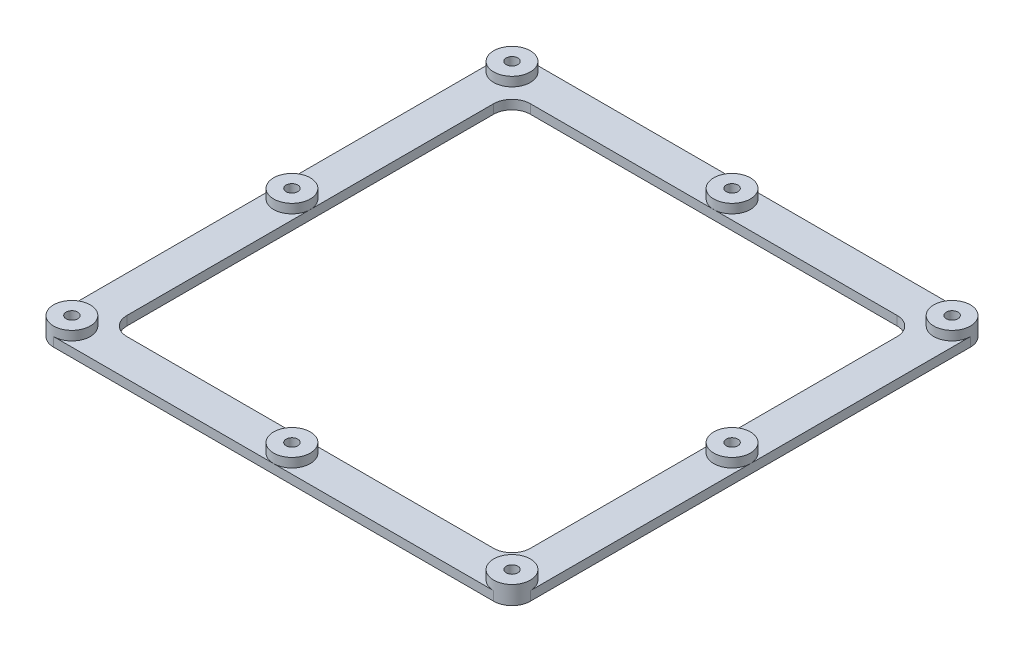
ISO-10303-21;
HEADER;
FILE_DESCRIPTION(('STEP AP214'),'2;1');
FILE_NAME('part.step','',(''),(''),'','','');
FILE_SCHEMA(('AUTOMOTIVE_DESIGN { 1 0 10303 214 1 1 1 1 }'));
ENDSEC;
DATA;
#1=APPLICATION_CONTEXT('core data for automotive mechanical design processes');
#2=APPLICATION_PROTOCOL_DEFINITION('international standard','automotive_design',2000,#1);
#3=PRODUCT_CONTEXT('',#1,'mechanical');
#4=PRODUCT('Part','Part','',(#3));
#5=PRODUCT_RELATED_PRODUCT_CATEGORY('part','',(#4));
#6=PRODUCT_DEFINITION_FORMATION('','',#4);
#7=PRODUCT_DEFINITION_CONTEXT('part definition',#1,'design');
#8=PRODUCT_DEFINITION('design','',#6,#7);
#9=PRODUCT_DEFINITION_SHAPE('','',#8);
#10=(LENGTH_UNIT() NAMED_UNIT(*) SI_UNIT(.MILLI.,.METRE.));
#11=(NAMED_UNIT(*) PLANE_ANGLE_UNIT() SI_UNIT($,.RADIAN.));
#12=(NAMED_UNIT(*) SI_UNIT($,.STERADIAN.) SOLID_ANGLE_UNIT());
#13=UNCERTAINTY_MEASURE_WITH_UNIT(LENGTH_MEASURE(1.E-05),#10,'distance_accuracy_value','');
#14=(GEOMETRIC_REPRESENTATION_CONTEXT(3) GLOBAL_UNCERTAINTY_ASSIGNED_CONTEXT((#13)) GLOBAL_UNIT_ASSIGNED_CONTEXT((#10,
#11,#12)) REPRESENTATION_CONTEXT('',''));
#15=CARTESIAN_POINT('',(0.,0.,0.));
#16=DIRECTION('',(0.,0.,1.));
#17=DIRECTION('',(1.,0.,0.));
#18=AXIS2_PLACEMENT_3D('',#15,#16,#17);
#19=CARTESIAN_POINT('',(0.,6.35,0.));
#20=DIRECTION('',(0.,1.,0.));
#21=DIRECTION('',(0.,0.,1.));
#22=AXIS2_PLACEMENT_3D('',#19,#20,#21);
#23=PLANE('',#22);
#24=CARTESIAN_POINT('',(-76.2,6.35,-76.2));
#25=DIRECTION('',(0.,1.,0.));
#26=DIRECTION('',(0.,0.,1.));
#27=AXIS2_PLACEMENT_3D('',#24,#25,#26);
#28=CIRCLE('',#27,2.01929999999999);
#29=CARTESIAN_POINT('',(-76.2,6.35,-74.1807));
#30=VERTEX_POINT('',#29);
#31=EDGE_CURVE('E235',#30,#30,#28,.T.);
#32=ORIENTED_EDGE('',*,*,#31,.F.);
#33=EDGE_LOOP('',(#32));
#34=FACE_BOUND('',#33,.T.);
#35=CARTESIAN_POINT('',(-76.2,6.35,-76.2));
#36=DIRECTION('',(0.,1.,0.));
#37=DIRECTION('',(0.,0.,1.));
#38=AXIS2_PLACEMENT_3D('',#35,#36,#37);
#39=CIRCLE('',#38,6.35);
#40=CARTESIAN_POINT('',(-76.2,6.35,-69.85));
#41=VERTEX_POINT('',#40);
#42=EDGE_CURVE('E350',#41,#41,#39,.T.);
#43=ORIENTED_EDGE('',*,*,#42,.T.);
#44=EDGE_LOOP('',(#43));
#45=FACE_BOUND('',#44,.T.);
#46=ADVANCED_FACE('F41',(#34,#45),#23,.T.);
#47=CARTESIAN_POINT('',(-76.2,6.35,0.));
#48=DIRECTION('',(0.,1.,0.));
#49=DIRECTION('',(0.,0.,1.));
#50=AXIS2_PLACEMENT_3D('',#47,#48,#49);
#51=CIRCLE('',#50,2.01929999999999);
#52=CARTESIAN_POINT('',(-76.2,6.35,2.01929999999999));
#53=VERTEX_POINT('',#52);
#54=EDGE_CURVE('E258',#53,#53,#51,.T.);
#55=ORIENTED_EDGE('',*,*,#54,.F.);
#56=EDGE_LOOP('',(#55));
#57=FACE_BOUND('',#56,.T.);
#58=CARTESIAN_POINT('',(-76.2,6.35,0.));
#59=DIRECTION('',(0.,1.,0.));
#60=DIRECTION('',(0.,0.,1.));
#61=AXIS2_PLACEMENT_3D('',#58,#59,#60);
#62=CIRCLE('',#61,6.35000000000001);
#63=CARTESIAN_POINT('',(-76.2,6.35,6.35000000000001));
#64=VERTEX_POINT('',#63);
#65=EDGE_CURVE('E423',#64,#64,#62,.T.);
#66=ORIENTED_EDGE('',*,*,#65,.T.);
#67=EDGE_LOOP('',(#66));
#68=FACE_BOUND('',#67,.T.);
#69=ADVANCED_FACE('F469',(#57,#68),#23,.T.);
#70=CARTESIAN_POINT('',(-76.2,6.35,76.2));
#71=DIRECTION('',(0.,1.,0.));
#72=DIRECTION('',(0.,0.,1.));
#73=AXIS2_PLACEMENT_3D('',#70,#71,#72);
#74=CIRCLE('',#73,2.01929999999999);
#75=CARTESIAN_POINT('',(-76.2,6.35,78.2193));
#76=VERTEX_POINT('',#75);
#77=EDGE_CURVE('E224',#76,#76,#74,.T.);
#78=ORIENTED_EDGE('',*,*,#77,.F.);
#79=EDGE_LOOP('',(#78));
#80=FACE_BOUND('',#79,.T.);
#81=CARTESIAN_POINT('',(-76.2,6.35,76.2));
#82=DIRECTION('',(0.,1.,0.));
#83=DIRECTION('',(0.,0.,1.));
#84=AXIS2_PLACEMENT_3D('',#81,#82,#83);
#85=CIRCLE('',#84,6.35);
#86=CARTESIAN_POINT('',(-76.2,6.35,82.55));
#87=VERTEX_POINT('',#86);
#88=EDGE_CURVE('E346',#87,#87,#85,.T.);
#89=ORIENTED_EDGE('',*,*,#88,.T.);
#90=EDGE_LOOP('',(#89));
#91=FACE_BOUND('',#90,.T.);
#92=ADVANCED_FACE('F476',(#80,#91),#23,.T.);
#93=CARTESIAN_POINT('',(0.,6.35,76.2));
#94=DIRECTION('',(0.,1.,0.));
#95=DIRECTION('',(0.,0.,1.));
#96=AXIS2_PLACEMENT_3D('',#93,#94,#95);
#97=CIRCLE('',#96,2.01929999999999);
#98=CARTESIAN_POINT('',(0.,6.35,78.2192999999999));
#99=VERTEX_POINT('',#98);
#100=EDGE_CURVE('E281',#99,#99,#97,.T.);
#101=ORIENTED_EDGE('',*,*,#100,.F.);
#102=EDGE_LOOP('',(#101));
#103=FACE_BOUND('',#102,.T.);
#104=CARTESIAN_POINT('',(0.,6.35,76.2));
#105=DIRECTION('',(0.,1.,0.));
#106=DIRECTION('',(0.,0.,1.));
#107=AXIS2_PLACEMENT_3D('',#104,#105,#106);
#108=CIRCLE('',#107,6.35000000000002);
#109=CARTESIAN_POINT('',(0.,6.35,82.55));
#110=VERTEX_POINT('',#109);
#111=EDGE_CURVE('E433',#110,#110,#108,.T.);
#112=ORIENTED_EDGE('',*,*,#111,.T.);
#113=EDGE_LOOP('',(#112));
#114=FACE_BOUND('',#113,.T.);
#115=ADVANCED_FACE('F625',(#103,#114),#23,.T.);
#116=CARTESIAN_POINT('',(76.2,6.35,76.2));
#117=DIRECTION('',(0.,1.,0.));
#118=DIRECTION('',(0.,0.,1.));
#119=AXIS2_PLACEMENT_3D('',#116,#117,#118);
#120=CIRCLE('',#119,2.01929999999999);
#121=CARTESIAN_POINT('',(76.2,6.35,78.2193));
#122=VERTEX_POINT('',#121);
#123=EDGE_CURVE('E248',#122,#122,#120,.T.);
#124=ORIENTED_EDGE('',*,*,#123,.F.);
#125=EDGE_LOOP('',(#124));
#126=FACE_BOUND('',#125,.T.);
#127=CARTESIAN_POINT('',(76.2,6.35,76.2));
#128=DIRECTION('',(0.,1.,0.));
#129=DIRECTION('',(0.,0.,1.));
#130=AXIS2_PLACEMENT_3D('',#127,#128,#129);
#131=CIRCLE('',#130,6.35);
#132=CARTESIAN_POINT('',(76.2,6.35,82.55));
#133=VERTEX_POINT('',#132);
#134=EDGE_CURVE('E376',#133,#133,#131,.T.);
#135=ORIENTED_EDGE('',*,*,#134,.T.);
#136=EDGE_LOOP('',(#135));
#137=FACE_BOUND('',#136,.T.);
#138=ADVANCED_FACE('F622',(#126,#137),#23,.T.);
#139=CARTESIAN_POINT('',(76.2,6.35,0.));
#140=DIRECTION('',(0.,1.,0.));
#141=DIRECTION('',(0.,0.,1.));
#142=AXIS2_PLACEMENT_3D('',#139,#140,#141);
#143=CIRCLE('',#142,2.01929999999999);
#144=CARTESIAN_POINT('',(76.2,6.35,2.01929999999999));
#145=VERTEX_POINT('',#144);
#146=EDGE_CURVE('E271',#145,#145,#143,.T.);
#147=ORIENTED_EDGE('',*,*,#146,.F.);
#148=EDGE_LOOP('',(#147));
#149=FACE_BOUND('',#148,.T.);
#150=CARTESIAN_POINT('',(76.2,6.35,0.));
#151=DIRECTION('',(0.,1.,0.));
#152=DIRECTION('',(0.,0.,1.));
#153=AXIS2_PLACEMENT_3D('',#150,#151,#152);
#154=CIRCLE('',#153,6.34999999999998);
#155=CARTESIAN_POINT('',(76.2,6.35,6.34999999999998));
#156=VERTEX_POINT('',#155);
#157=EDGE_CURVE('E443',#156,#156,#154,.T.);
#158=ORIENTED_EDGE('',*,*,#157,.T.);
#159=EDGE_LOOP('',(#158));
#160=FACE_BOUND('',#159,.T.);
#161=ADVANCED_FACE('F493',(#149,#160),#23,.T.);
#162=CARTESIAN_POINT('',(76.2,6.35,-76.2));
#163=DIRECTION('',(0.,1.,0.));
#164=DIRECTION('',(0.,0.,1.));
#165=AXIS2_PLACEMENT_3D('',#162,#163,#164);
#166=CIRCLE('',#165,2.01929999999999);
#167=CARTESIAN_POINT('',(76.2,6.35,-74.1807));
#168=VERTEX_POINT('',#167);
#169=EDGE_CURVE('E241',#168,#168,#166,.T.);
#170=ORIENTED_EDGE('',*,*,#169,.F.);
#171=EDGE_LOOP('',(#170));
#172=FACE_BOUND('',#171,.T.);
#173=CARTESIAN_POINT('',(76.2,6.35,-76.2));
#174=DIRECTION('',(0.,1.,0.));
#175=DIRECTION('',(0.,0.,1.));
#176=AXIS2_PLACEMENT_3D('',#173,#174,#175);
#177=CIRCLE('',#176,6.35);
#178=CARTESIAN_POINT('',(76.2,6.35,-69.85));
#179=VERTEX_POINT('',#178);
#180=EDGE_CURVE('E373',#179,#179,#177,.T.);
#181=ORIENTED_EDGE('',*,*,#180,.T.);
#182=EDGE_LOOP('',(#181));
#183=FACE_BOUND('',#182,.T.);
#184=ADVANCED_FACE('F484',(#172,#183),#23,.T.);
#185=CARTESIAN_POINT('',(0.,6.35,-76.2));
#186=DIRECTION('',(0.,1.,0.));
#187=DIRECTION('',(0.,0.,1.));
#188=AXIS2_PLACEMENT_3D('',#185,#186,#187);
#189=CIRCLE('',#188,2.01929999999999);
#190=CARTESIAN_POINT('',(0.,6.35,-74.1807));
#191=VERTEX_POINT('',#190);
#192=EDGE_CURVE('E264',#191,#191,#189,.T.);
#193=ORIENTED_EDGE('',*,*,#192,.F.);
#194=EDGE_LOOP('',(#193));
#195=FACE_BOUND('',#194,.T.);
#196=CARTESIAN_POINT('',(0.,6.35,-76.2));
#197=DIRECTION('',(0.,1.,0.));
#198=DIRECTION('',(0.,0.,1.));
#199=AXIS2_PLACEMENT_3D('',#196,#197,#198);
#200=CIRCLE('',#199,6.34999999999999);
#201=CARTESIAN_POINT('',(0.,6.35,-69.85));
#202=VERTEX_POINT('',#201);
#203=EDGE_CURVE('E197',#202,#202,#200,.T.);
#204=ORIENTED_EDGE('',*,*,#203,.T.);
#205=EDGE_LOOP('',(#204));
#206=FACE_BOUND('',#205,.T.);
#207=ADVANCED_FACE('F454',(#195,#206),#23,.T.);
#208=CARTESIAN_POINT('',(-82.55,6.35,82.55));
#209=DIRECTION('',(1.,0.,0.));
#210=DIRECTION('',(0.,0.,-1.));
#211=AXIS2_PLACEMENT_3D('',#208,#209,#210);
#212=PLANE('',#211);
#213=DIRECTION('',(0.,0.,1.));
#214=VECTOR('',#213,1.);
#215=CARTESIAN_POINT('',(-82.55,3.175,82.55));
#216=LINE('',#215,#214);
#217=CARTESIAN_POINT('',(-82.55,3.175,-76.2));
#218=VERTEX_POINT('',#217);
#219=CARTESIAN_POINT('',(-82.55,3.175,0.));
#220=VERTEX_POINT('',#219);
#221=EDGE_CURVE('E223',#218,#220,#216,.T.);
#222=ORIENTED_EDGE('',*,*,#221,.F.);
#223=DIRECTION('',(0.,-1.,0.));
#224=VECTOR('',#223,1.);
#225=CARTESIAN_POINT('',(-82.55,6.35,-76.2));
#226=LINE('',#225,#224);
#227=CARTESIAN_POINT('',(-82.55,0.,-76.2));
#228=VERTEX_POINT('',#227);
#229=EDGE_CURVE('E388',#218,#228,#226,.T.);
#230=ORIENTED_EDGE('',*,*,#229,.T.);
#231=DIRECTION('',(0.,0.,1.));
#232=VECTOR('',#231,1.);
#233=CARTESIAN_POINT('',(-82.55,0.,82.55));
#234=LINE('',#233,#232);
#235=CARTESIAN_POINT('',(-82.55,0.,76.2));
#236=VERTEX_POINT('',#235);
#237=EDGE_CURVE('E300',#228,#236,#234,.T.);
#238=ORIENTED_EDGE('',*,*,#237,.T.);
#239=DIRECTION('',(0.,-1.,0.));
#240=VECTOR('',#239,1.);
#241=CARTESIAN_POINT('',(-82.55,6.35,76.2));
#242=LINE('',#241,#240);
#243=CARTESIAN_POINT('',(-82.55,3.175,76.2));
#244=VERTEX_POINT('',#243);
#245=EDGE_CURVE('E385',#236,#244,#242,.F.);
#246=ORIENTED_EDGE('',*,*,#245,.T.);
#247=EDGE_CURVE('E221',#220,#244,#216,.T.);
#248=ORIENTED_EDGE('',*,*,#247,.F.);
#249=EDGE_LOOP('',(#222,#230,#238,#246,#248));
#250=FACE_BOUND('',#249,.T.);
#251=ADVANCED_FACE('F483',(#250),#212,.F.);
#252=CARTESIAN_POINT('',(82.55,6.35,82.55));
#253=DIRECTION('',(0.,0.,-1.));
#254=DIRECTION('',(-1.,0.,0.));
#255=AXIS2_PLACEMENT_3D('',#252,#253,#254);
#256=PLANE('',#255);
#257=DIRECTION('',(1.,0.,0.));
#258=VECTOR('',#257,1.);
#259=CARTESIAN_POINT('',(82.55,3.175,82.55));
#260=LINE('',#259,#258);
#261=CARTESIAN_POINT('',(-76.2,3.175,82.55));
#262=VERTEX_POINT('',#261);
#263=CARTESIAN_POINT('',(0.,3.175,82.55));
#264=VERTEX_POINT('',#263);
#265=EDGE_CURVE('E220',#262,#264,#260,.T.);
#266=ORIENTED_EDGE('',*,*,#265,.F.);
#267=DIRECTION('',(0.,-1.,0.));
#268=VECTOR('',#267,1.);
#269=CARTESIAN_POINT('',(-76.2,6.35,82.55));
#270=LINE('',#269,#268);
#271=CARTESIAN_POINT('',(-76.2,0.,82.55));
#272=VERTEX_POINT('',#271);
#273=EDGE_CURVE('E341',#262,#272,#270,.T.);
#274=ORIENTED_EDGE('',*,*,#273,.T.);
#275=DIRECTION('',(1.,0.,0.));
#276=VECTOR('',#275,1.);
#277=CARTESIAN_POINT('',(82.55,0.,82.55));
#278=LINE('',#277,#276);
#279=CARTESIAN_POINT('',(76.2,0.,82.55));
#280=VERTEX_POINT('',#279);
#281=EDGE_CURVE('E303',#272,#280,#278,.T.);
#282=ORIENTED_EDGE('',*,*,#281,.T.);
#283=DIRECTION('',(0.,-1.,0.));
#284=VECTOR('',#283,1.);
#285=CARTESIAN_POINT('',(76.2,6.35,82.55));
#286=LINE('',#285,#284);
#287=CARTESIAN_POINT('',(76.2,3.175,82.55));
#288=VERTEX_POINT('',#287);
#289=EDGE_CURVE('E343',#280,#288,#286,.F.);
#290=ORIENTED_EDGE('',*,*,#289,.T.);
#291=EDGE_CURVE('E218',#264,#288,#260,.T.);
#292=ORIENTED_EDGE('',*,*,#291,.F.);
#293=EDGE_LOOP('',(#266,#274,#282,#290,#292));
#294=FACE_BOUND('',#293,.T.);
#295=ADVANCED_FACE('F490',(#294),#256,.F.);
#296=CARTESIAN_POINT('',(82.55,6.35,82.55));
#297=DIRECTION('',(-1.,0.,0.));
#298=DIRECTION('',(0.,0.,1.));
#299=AXIS2_PLACEMENT_3D('',#296,#297,#298);
#300=PLANE('',#299);
#301=DIRECTION('',(0.,0.,-1.));
#302=VECTOR('',#301,1.);
#303=CARTESIAN_POINT('',(82.55,3.175,82.55));
#304=LINE('',#303,#302);
#305=CARTESIAN_POINT('',(82.55,3.175,76.2));
#306=VERTEX_POINT('',#305);
#307=CARTESIAN_POINT('',(82.55,3.175,0.));
#308=VERTEX_POINT('',#307);
#309=EDGE_CURVE('E217',#306,#308,#304,.T.);
#310=ORIENTED_EDGE('',*,*,#309,.F.);
#311=DIRECTION('',(0.,-1.,0.));
#312=VECTOR('',#311,1.);
#313=CARTESIAN_POINT('',(82.55,6.35,76.2));
#314=LINE('',#313,#312);
#315=CARTESIAN_POINT('',(82.55,0.,76.2));
#316=VERTEX_POINT('',#315);
#317=EDGE_CURVE('E332',#306,#316,#314,.T.);
#318=ORIENTED_EDGE('',*,*,#317,.T.);
#319=DIRECTION('',(0.,0.,-1.));
#320=VECTOR('',#319,1.);
#321=CARTESIAN_POINT('',(82.55,0.,82.55));
#322=LINE('',#321,#320);
#323=CARTESIAN_POINT('',(82.55,0.,-76.2));
#324=VERTEX_POINT('',#323);
#325=EDGE_CURVE('E305',#316,#324,#322,.T.);
#326=ORIENTED_EDGE('',*,*,#325,.T.);
#327=DIRECTION('',(0.,-1.,0.));
#328=VECTOR('',#327,1.);
#329=CARTESIAN_POINT('',(82.55,6.35,-76.2));
#330=LINE('',#329,#328);
#331=CARTESIAN_POINT('',(82.55,3.175,-76.2));
#332=VERTEX_POINT('',#331);
#333=EDGE_CURVE('E329',#324,#332,#330,.F.);
#334=ORIENTED_EDGE('',*,*,#333,.T.);
#335=EDGE_CURVE('E215',#308,#332,#304,.T.);
#336=ORIENTED_EDGE('',*,*,#335,.F.);
#337=EDGE_LOOP('',(#310,#318,#326,#334,#336));
#338=FACE_BOUND('',#337,.T.);
#339=ADVANCED_FACE('F536',(#338),#300,.F.);
#340=CARTESIAN_POINT('',(82.55,6.35,-82.55));
#341=DIRECTION('',(0.,0.,1.));
#342=DIRECTION('',(1.,0.,0.));
#343=AXIS2_PLACEMENT_3D('',#340,#341,#342);
#344=PLANE('',#343);
#345=DIRECTION('',(-1.,0.,0.));
#346=VECTOR('',#345,1.);
#347=CARTESIAN_POINT('',(82.55,3.175,-82.55));
#348=LINE('',#347,#346);
#349=CARTESIAN_POINT('',(76.2,3.175,-82.55));
#350=VERTEX_POINT('',#349);
#351=CARTESIAN_POINT('',(0.,3.175,-82.55));
#352=VERTEX_POINT('',#351);
#353=EDGE_CURVE('E203',#350,#352,#348,.T.);
#354=ORIENTED_EDGE('',*,*,#353,.F.);
#355=DIRECTION('',(0.,-1.,0.));
#356=VECTOR('',#355,1.);
#357=CARTESIAN_POINT('',(76.2,6.35,-82.55));
#358=LINE('',#357,#356);
#359=CARTESIAN_POINT('',(76.2,0.,-82.55));
#360=VERTEX_POINT('',#359);
#361=EDGE_CURVE('E383',#350,#360,#358,.T.);
#362=ORIENTED_EDGE('',*,*,#361,.T.);
#363=DIRECTION('',(-1.,0.,0.));
#364=VECTOR('',#363,1.);
#365=CARTESIAN_POINT('',(82.55,0.,-82.55));
#366=LINE('',#365,#364);
#367=CARTESIAN_POINT('',(-76.2,0.,-82.55));
#368=VERTEX_POINT('',#367);
#369=EDGE_CURVE('E308',#360,#368,#366,.T.);
#370=ORIENTED_EDGE('',*,*,#369,.T.);
#371=DIRECTION('',(0.,-1.,0.));
#372=VECTOR('',#371,1.);
#373=CARTESIAN_POINT('',(-76.2,6.35,-82.55));
#374=LINE('',#373,#372);
#375=CARTESIAN_POINT('',(-76.2,3.175,-82.55));
#376=VERTEX_POINT('',#375);
#377=EDGE_CURVE('E380',#368,#376,#374,.F.);
#378=ORIENTED_EDGE('',*,*,#377,.T.);
#379=EDGE_CURVE('E210',#352,#376,#348,.T.);
#380=ORIENTED_EDGE('',*,*,#379,.F.);
#381=EDGE_LOOP('',(#354,#362,#370,#378,#380));
#382=FACE_BOUND('',#381,.T.);
#383=ADVANCED_FACE('F531',(#382),#344,.F.);
#384=CARTESIAN_POINT('',(-69.85,6.35,69.85));
#385=DIRECTION('',(1.,0.,0.));
#386=DIRECTION('',(0.,0.,-1.));
#387=AXIS2_PLACEMENT_3D('',#384,#385,#386);
#388=PLANE('',#387);
#389=DIRECTION('',(0.,-1.,0.));
#390=VECTOR('',#389,1.);
#391=CARTESIAN_POINT('',(-69.85,6.35,-63.5));
#392=LINE('',#391,#390);
#393=CARTESIAN_POINT('',(-69.85,0.,-63.5));
#394=VERTEX_POINT('',#393);
#395=CARTESIAN_POINT('',(-69.85,3.175,-63.5));
#396=VERTEX_POINT('',#395);
#397=EDGE_CURVE('E311',#394,#396,#392,.F.);
#398=ORIENTED_EDGE('',*,*,#397,.T.);
#399=DIRECTION('',(0.,0.,1.));
#400=VECTOR('',#399,1.);
#401=CARTESIAN_POINT('',(-69.85,3.175,69.85));
#402=LINE('',#401,#400);
#403=CARTESIAN_POINT('',(-69.85,3.175,0.));
#404=VERTEX_POINT('',#403);
#405=EDGE_CURVE('E403',#396,#404,#402,.T.);
#406=ORIENTED_EDGE('',*,*,#405,.T.);
#407=CARTESIAN_POINT('',(-69.85,3.175,63.5));
#408=VERTEX_POINT('',#407);
#409=EDGE_CURVE('E405',#404,#408,#402,.T.);
#410=ORIENTED_EDGE('',*,*,#409,.T.);
#411=DIRECTION('',(0.,-1.,0.));
#412=VECTOR('',#411,1.);
#413=CARTESIAN_POINT('',(-69.85,0.,63.5));
#414=LINE('',#413,#412);
#415=CARTESIAN_POINT('',(-69.85,0.,63.5));
#416=VERTEX_POINT('',#415);
#417=EDGE_CURVE('E314',#408,#416,#414,.T.);
#418=ORIENTED_EDGE('',*,*,#417,.T.);
#419=DIRECTION('',(0.,0.,1.));
#420=VECTOR('',#419,1.);
#421=CARTESIAN_POINT('',(-69.85,0.,69.85));
#422=LINE('',#421,#420);
#423=EDGE_CURVE('E288',#394,#416,#422,.T.);
#424=ORIENTED_EDGE('',*,*,#423,.F.);
#425=EDGE_LOOP('',(#398,#406,#410,#418,#424));
#426=FACE_BOUND('',#425,.T.);
#427=ADVANCED_FACE('F528',(#426),#388,.T.);
#428=CARTESIAN_POINT('',(69.85,6.35,69.85));
#429=DIRECTION('',(0.,0.,-1.));
#430=DIRECTION('',(-1.,0.,0.));
#431=AXIS2_PLACEMENT_3D('',#428,#429,#430);
#432=PLANE('',#431);
#433=DIRECTION('',(0.,-1.,0.));
#434=VECTOR('',#433,1.);
#435=CARTESIAN_POINT('',(-63.5,6.35,69.85));
#436=LINE('',#435,#434);
#437=CARTESIAN_POINT('',(-63.5,0.,69.85));
#438=VERTEX_POINT('',#437);
#439=CARTESIAN_POINT('',(-63.5,3.175,69.85));
#440=VERTEX_POINT('',#439);
#441=EDGE_CURVE('E318',#438,#440,#436,.F.);
#442=ORIENTED_EDGE('',*,*,#441,.T.);
#443=DIRECTION('',(1.,0.,0.));
#444=VECTOR('',#443,1.);
#445=CARTESIAN_POINT('',(69.85,3.175,69.85));
#446=LINE('',#445,#444);
#447=CARTESIAN_POINT('',(0.,3.175,69.8499999999999));
#448=VERTEX_POINT('',#447);
#449=EDGE_CURVE('E412',#440,#448,#446,.T.);
#450=ORIENTED_EDGE('',*,*,#449,.T.);
#451=CARTESIAN_POINT('',(63.5,3.175,69.85));
#452=VERTEX_POINT('',#451);
#453=EDGE_CURVE('E413',#448,#452,#446,.T.);
#454=ORIENTED_EDGE('',*,*,#453,.T.);
#455=DIRECTION('',(0.,-1.,0.));
#456=VECTOR('',#455,1.);
#457=CARTESIAN_POINT('',(63.5,0.,69.85));
#458=LINE('',#457,#456);
#459=CARTESIAN_POINT('',(63.5,0.,69.85));
#460=VERTEX_POINT('',#459);
#461=EDGE_CURVE('E316',#452,#460,#458,.T.);
#462=ORIENTED_EDGE('',*,*,#461,.T.);
#463=DIRECTION('',(1.,0.,0.));
#464=VECTOR('',#463,1.);
#465=CARTESIAN_POINT('',(69.85,0.,69.85));
#466=LINE('',#465,#464);
#467=EDGE_CURVE('E291',#438,#460,#466,.T.);
#468=ORIENTED_EDGE('',*,*,#467,.F.);
#469=EDGE_LOOP('',(#442,#450,#454,#462,#468));
#470=FACE_BOUND('',#469,.T.);
#471=ADVANCED_FACE('F525',(#470),#432,.T.);
#472=CARTESIAN_POINT('',(69.85,6.35,69.85));
#473=DIRECTION('',(-1.,0.,0.));
#474=DIRECTION('',(0.,0.,1.));
#475=AXIS2_PLACEMENT_3D('',#472,#473,#474);
#476=PLANE('',#475);
#477=DIRECTION('',(0.,-1.,0.));
#478=VECTOR('',#477,1.);
#479=CARTESIAN_POINT('',(69.85,6.35,63.5));
#480=LINE('',#479,#478);
#481=CARTESIAN_POINT('',(69.85,0.,63.5));
#482=VERTEX_POINT('',#481);
#483=CARTESIAN_POINT('',(69.85,3.175,63.5));
#484=VERTEX_POINT('',#483);
#485=EDGE_CURVE('E324',#482,#484,#480,.F.);
#486=ORIENTED_EDGE('',*,*,#485,.T.);
#487=DIRECTION('',(0.,0.,-1.));
#488=VECTOR('',#487,1.);
#489=CARTESIAN_POINT('',(69.85,3.175,69.85));
#490=LINE('',#489,#488);
#491=CARTESIAN_POINT('',(69.85,3.175,0.));
#492=VERTEX_POINT('',#491);
#493=EDGE_CURVE('E56',#484,#492,#490,.T.);
#494=ORIENTED_EDGE('',*,*,#493,.T.);
#495=CARTESIAN_POINT('',(69.85,3.175,-63.5));
#496=VERTEX_POINT('',#495);
#497=EDGE_CURVE('E409',#492,#496,#490,.T.);
#498=ORIENTED_EDGE('',*,*,#497,.T.);
#499=DIRECTION('',(0.,-1.,0.));
#500=VECTOR('',#499,1.);
#501=CARTESIAN_POINT('',(69.85,0.,-63.5));
#502=LINE('',#501,#500);
#503=CARTESIAN_POINT('',(69.85,0.,-63.5));
#504=VERTEX_POINT('',#503);
#505=EDGE_CURVE('E327',#496,#504,#502,.T.);
#506=ORIENTED_EDGE('',*,*,#505,.T.);
#507=DIRECTION('',(0.,0.,-1.));
#508=VECTOR('',#507,1.);
#509=CARTESIAN_POINT('',(69.85,0.,69.85));
#510=LINE('',#509,#508);
#511=EDGE_CURVE('E294',#482,#504,#510,.T.);
#512=ORIENTED_EDGE('',*,*,#511,.F.);
#513=EDGE_LOOP('',(#486,#494,#498,#506,#512));
#514=FACE_BOUND('',#513,.T.);
#515=ADVANCED_FACE('F522',(#514),#476,.T.);
#516=CARTESIAN_POINT('',(69.85,6.35,-69.85));
#517=DIRECTION('',(0.,0.,1.));
#518=DIRECTION('',(1.,0.,0.));
#519=AXIS2_PLACEMENT_3D('',#516,#517,#518);
#520=PLANE('',#519);
#521=DIRECTION('',(0.,-1.,0.));
#522=VECTOR('',#521,1.);
#523=CARTESIAN_POINT('',(63.5,6.35,-69.85));
#524=LINE('',#523,#522);
#525=CARTESIAN_POINT('',(63.5,0.,-69.85));
#526=VERTEX_POINT('',#525);
#527=CARTESIAN_POINT('',(63.5,3.175,-69.85));
#528=VERTEX_POINT('',#527);
#529=EDGE_CURVE('E209',#526,#528,#524,.F.);
#530=ORIENTED_EDGE('',*,*,#529,.T.);
#531=DIRECTION('',(-1.,0.,0.));
#532=VECTOR('',#531,1.);
#533=CARTESIAN_POINT('',(69.85,3.175,-69.85));
#534=LINE('',#533,#532);
#535=CARTESIAN_POINT('',(0.,3.175,-69.85));
#536=VERTEX_POINT('',#535);
#537=EDGE_CURVE('E190',#528,#536,#534,.T.);
#538=ORIENTED_EDGE('',*,*,#537,.T.);
#539=CARTESIAN_POINT('',(-63.5,3.175,-69.85));
#540=VERTEX_POINT('',#539);
#541=EDGE_CURVE('E180',#536,#540,#534,.T.);
#542=ORIENTED_EDGE('',*,*,#541,.T.);
#543=DIRECTION('',(0.,-1.,0.));
#544=VECTOR('',#543,1.);
#545=CARTESIAN_POINT('',(-63.5,0.,-69.85));
#546=LINE('',#545,#544);
#547=CARTESIAN_POINT('',(-63.5,0.,-69.85));
#548=VERTEX_POINT('',#547);
#549=EDGE_CURVE('E322',#540,#548,#546,.T.);
#550=ORIENTED_EDGE('',*,*,#549,.T.);
#551=DIRECTION('',(-1.,0.,0.));
#552=VECTOR('',#551,1.);
#553=CARTESIAN_POINT('',(69.85,0.,-69.85));
#554=LINE('',#553,#552);
#555=EDGE_CURVE('E297',#526,#548,#554,.T.);
#556=ORIENTED_EDGE('',*,*,#555,.F.);
#557=EDGE_LOOP('',(#530,#538,#542,#550,#556));
#558=FACE_BOUND('',#557,.T.);
#559=ADVANCED_FACE('F206',(#558),#520,.T.);
#560=CARTESIAN_POINT('',(-63.5,6.35,63.5));
#561=DIRECTION('',(0.,1.,0.));
#562=DIRECTION('',(0.,0.,1.));
#563=AXIS2_PLACEMENT_3D('',#560,#561,#562);
#564=CYLINDRICAL_SURFACE('',#563,6.35);
#565=CARTESIAN_POINT('',(-63.5,3.175,63.5));
#566=DIRECTION('',(0.,1.,0.));
#567=DIRECTION('',(0.,0.,1.));
#568=AXIS2_PLACEMENT_3D('',#565,#566,#567);
#569=CIRCLE('',#568,6.35);
#570=EDGE_CURVE('E410',#440,#408,#569,.F.);
#571=ORIENTED_EDGE('',*,*,#570,.F.);
#572=ORIENTED_EDGE('',*,*,#441,.F.);
#573=CARTESIAN_POINT('',(-63.5,0.,63.5));
#574=DIRECTION('',(0.,1.,0.));
#575=DIRECTION('',(0.,0.,1.));
#576=AXIS2_PLACEMENT_3D('',#573,#574,#575);
#577=CIRCLE('',#576,6.35);
#578=EDGE_CURVE('E390',#416,#438,#577,.T.);
#579=ORIENTED_EDGE('',*,*,#578,.F.);
#580=ORIENTED_EDGE('',*,*,#417,.F.);
#581=EDGE_LOOP('',(#571,#572,#579,#580));
#582=FACE_BOUND('',#581,.T.);
#583=ADVANCED_FACE('F521',(#582),#564,.F.);
#584=CARTESIAN_POINT('',(-63.5,6.35,-63.5));
#585=DIRECTION('',(0.,1.,0.));
#586=DIRECTION('',(0.,0.,1.));
#587=AXIS2_PLACEMENT_3D('',#584,#585,#586);
#588=CYLINDRICAL_SURFACE('',#587,6.35);
#589=CARTESIAN_POINT('',(-63.5,3.175,-63.5));
#590=DIRECTION('',(0.,1.,0.));
#591=DIRECTION('',(0.,0.,1.));
#592=AXIS2_PLACEMENT_3D('',#589,#590,#591);
#593=CIRCLE('',#592,6.35);
#594=EDGE_CURVE('E186',#396,#540,#593,.F.);
#595=ORIENTED_EDGE('',*,*,#594,.F.);
#596=ORIENTED_EDGE('',*,*,#397,.F.);
#597=CARTESIAN_POINT('',(-63.5,0.,-63.5));
#598=DIRECTION('',(0.,1.,0.));
#599=DIRECTION('',(0.,0.,1.));
#600=AXIS2_PLACEMENT_3D('',#597,#598,#599);
#601=CIRCLE('',#600,6.35);
#602=EDGE_CURVE('E392',#548,#394,#601,.T.);
#603=ORIENTED_EDGE('',*,*,#602,.F.);
#604=ORIENTED_EDGE('',*,*,#549,.F.);
#605=EDGE_LOOP('',(#595,#596,#603,#604));
#606=FACE_BOUND('',#605,.T.);
#607=ADVANCED_FACE('F542',(#606),#588,.F.);
#608=CARTESIAN_POINT('',(63.5,6.35,-63.5));
#609=DIRECTION('',(0.,1.,0.));
#610=DIRECTION('',(0.,0.,1.));
#611=AXIS2_PLACEMENT_3D('',#608,#609,#610);
#612=CYLINDRICAL_SURFACE('',#611,6.35);
#613=CARTESIAN_POINT('',(63.5,3.175,-63.5));
#614=DIRECTION('',(0.,1.,0.));
#615=DIRECTION('',(0.,0.,1.));
#616=AXIS2_PLACEMENT_3D('',#613,#614,#615);
#617=CIRCLE('',#616,6.35);
#618=EDGE_CURVE('E401',#528,#496,#617,.F.);
#619=ORIENTED_EDGE('',*,*,#618,.F.);
#620=ORIENTED_EDGE('',*,*,#529,.F.);
#621=CARTESIAN_POINT('',(63.5,0.,-63.5));
#622=DIRECTION('',(0.,1.,0.));
#623=DIRECTION('',(0.,0.,1.));
#624=AXIS2_PLACEMENT_3D('',#621,#622,#623);
#625=CIRCLE('',#624,6.35);
#626=EDGE_CURVE('E49',#504,#526,#625,.T.);
#627=ORIENTED_EDGE('',*,*,#626,.F.);
#628=ORIENTED_EDGE('',*,*,#505,.F.);
#629=EDGE_LOOP('',(#619,#620,#627,#628));
#630=FACE_BOUND('',#629,.T.);
#631=ADVANCED_FACE('F400',(#630),#612,.F.);
#632=CARTESIAN_POINT('',(63.5,6.35,63.5));
#633=DIRECTION('',(0.,1.,0.));
#634=DIRECTION('',(0.,0.,1.));
#635=AXIS2_PLACEMENT_3D('',#632,#633,#634);
#636=CYLINDRICAL_SURFACE('',#635,6.35);
#637=CARTESIAN_POINT('',(63.5,3.175,63.5));
#638=DIRECTION('',(0.,1.,0.));
#639=DIRECTION('',(0.,0.,1.));
#640=AXIS2_PLACEMENT_3D('',#637,#638,#639);
#641=CIRCLE('',#640,6.35);
#642=EDGE_CURVE('E417',#484,#452,#641,.F.);
#643=ORIENTED_EDGE('',*,*,#642,.F.);
#644=ORIENTED_EDGE('',*,*,#485,.F.);
#645=CARTESIAN_POINT('',(63.5,0.,63.5));
#646=DIRECTION('',(0.,1.,0.));
#647=DIRECTION('',(0.,0.,1.));
#648=AXIS2_PLACEMENT_3D('',#645,#646,#647);
#649=CIRCLE('',#648,6.35);
#650=EDGE_CURVE('E13',#460,#482,#649,.T.);
#651=ORIENTED_EDGE('',*,*,#650,.F.);
#652=ORIENTED_EDGE('',*,*,#461,.F.);
#653=EDGE_LOOP('',(#643,#644,#651,#652));
#654=FACE_BOUND('',#653,.T.);
#655=ADVANCED_FACE('F559',(#654),#636,.F.);
#656=CARTESIAN_POINT('',(0.,0.,0.));
#657=DIRECTION('',(0.,1.,0.));
#658=DIRECTION('',(0.,0.,1.));
#659=AXIS2_PLACEMENT_3D('',#656,#657,#658);
#660=PLANE('',#659);
#661=CARTESIAN_POINT('',(-76.2,0.,76.2));
#662=DIRECTION('',(0.,1.,0.));
#663=DIRECTION('',(0.,0.,1.));
#664=AXIS2_PLACEMENT_3D('',#661,#662,#663);
#665=CIRCLE('',#664,2.0193);
#666=CARTESIAN_POINT('',(-76.2,0.,78.2193));
#667=VERTEX_POINT('',#666);
#668=EDGE_CURVE('E228',#667,#667,#665,.T.);
#669=ORIENTED_EDGE('',*,*,#668,.T.);
#670=EDGE_LOOP('',(#669));
#671=FACE_BOUND('',#670,.T.);
#672=CARTESIAN_POINT('',(-76.2,0.,-76.2));
#673=DIRECTION('',(0.,1.,0.));
#674=DIRECTION('',(0.,0.,1.));
#675=AXIS2_PLACEMENT_3D('',#672,#673,#674);
#676=CIRCLE('',#675,2.0193);
#677=CARTESIAN_POINT('',(-76.2,0.,-74.1807));
#678=VERTEX_POINT('',#677);
#679=EDGE_CURVE('E239',#678,#678,#676,.T.);
#680=ORIENTED_EDGE('',*,*,#679,.T.);
#681=EDGE_LOOP('',(#680));
#682=FACE_BOUND('',#681,.T.);
#683=CARTESIAN_POINT('',(76.2,0.,-76.2));
#684=DIRECTION('',(0.,1.,0.));
#685=DIRECTION('',(0.,0.,1.));
#686=AXIS2_PLACEMENT_3D('',#683,#684,#685);
#687=CIRCLE('',#686,2.0193);
#688=CARTESIAN_POINT('',(76.2,0.,-74.1807));
#689=VERTEX_POINT('',#688);
#690=EDGE_CURVE('E245',#689,#689,#687,.T.);
#691=ORIENTED_EDGE('',*,*,#690,.T.);
#692=EDGE_LOOP('',(#691));
#693=FACE_BOUND('',#692,.T.);
#694=CARTESIAN_POINT('',(76.2,0.,76.2));
#695=DIRECTION('',(0.,1.,0.));
#696=DIRECTION('',(0.,0.,1.));
#697=AXIS2_PLACEMENT_3D('',#694,#695,#696);
#698=CIRCLE('',#697,2.0193);
#699=CARTESIAN_POINT('',(76.2,0.,78.2193));
#700=VERTEX_POINT('',#699);
#701=EDGE_CURVE('E252',#700,#700,#698,.T.);
#702=ORIENTED_EDGE('',*,*,#701,.T.);
#703=EDGE_LOOP('',(#702));
#704=FACE_BOUND('',#703,.T.);
#705=CARTESIAN_POINT('',(-76.2,0.,0.));
#706=DIRECTION('',(0.,1.,0.));
#707=DIRECTION('',(0.,0.,1.));
#708=AXIS2_PLACEMENT_3D('',#705,#706,#707);
#709=CIRCLE('',#708,2.0193);
#710=CARTESIAN_POINT('',(-76.2,0.,2.0193));
#711=VERTEX_POINT('',#710);
#712=EDGE_CURVE('E262',#711,#711,#709,.T.);
#713=ORIENTED_EDGE('',*,*,#712,.T.);
#714=EDGE_LOOP('',(#713));
#715=FACE_BOUND('',#714,.T.);
#716=CARTESIAN_POINT('',(0.,0.,-76.2));
#717=DIRECTION('',(0.,1.,0.));
#718=DIRECTION('',(0.,0.,1.));
#719=AXIS2_PLACEMENT_3D('',#716,#717,#718);
#720=CIRCLE('',#719,2.0193);
#721=CARTESIAN_POINT('',(0.,0.,-74.1807));
#722=VERTEX_POINT('',#721);
#723=EDGE_CURVE('E268',#722,#722,#720,.T.);
#724=ORIENTED_EDGE('',*,*,#723,.T.);
#725=EDGE_LOOP('',(#724));
#726=FACE_BOUND('',#725,.T.);
#727=CARTESIAN_POINT('',(76.2,0.,0.));
#728=DIRECTION('',(0.,1.,0.));
#729=DIRECTION('',(0.,0.,1.));
#730=AXIS2_PLACEMENT_3D('',#727,#728,#729);
#731=CIRCLE('',#730,2.0193);
#732=CARTESIAN_POINT('',(76.2,0.,2.0193));
#733=VERTEX_POINT('',#732);
#734=EDGE_CURVE('E275',#733,#733,#731,.T.);
#735=ORIENTED_EDGE('',*,*,#734,.T.);
#736=EDGE_LOOP('',(#735));
#737=FACE_BOUND('',#736,.T.);
#738=CARTESIAN_POINT('',(0.,0.,76.2));
#739=DIRECTION('',(0.,1.,0.));
#740=DIRECTION('',(0.,0.,1.));
#741=AXIS2_PLACEMENT_3D('',#738,#739,#740);
#742=CIRCLE('',#741,2.0193);
#743=CARTESIAN_POINT('',(0.,0.,78.2193));
#744=VERTEX_POINT('',#743);
#745=EDGE_CURVE('E285',#744,#744,#742,.T.);
#746=ORIENTED_EDGE('',*,*,#745,.T.);
#747=EDGE_LOOP('',(#746));
#748=FACE_BOUND('',#747,.T.);
#749=ORIENTED_EDGE('',*,*,#325,.F.);
#750=CARTESIAN_POINT('',(76.2,0.,76.2));
#751=DIRECTION('',(0.,1.,0.));
#752=DIRECTION('',(0.,0.,1.));
#753=AXIS2_PLACEMENT_3D('',#750,#751,#752);
#754=CIRCLE('',#753,6.35);
#755=EDGE_CURVE('E64',#316,#280,#754,.F.);
#756=ORIENTED_EDGE('',*,*,#755,.T.);
#757=ORIENTED_EDGE('',*,*,#281,.F.);
#758=CARTESIAN_POINT('',(-76.2,0.,76.2));
#759=DIRECTION('',(0.,1.,0.));
#760=DIRECTION('',(0.,0.,1.));
#761=AXIS2_PLACEMENT_3D('',#758,#759,#760);
#762=CIRCLE('',#761,6.35);
#763=EDGE_CURVE('E334',#272,#236,#762,.F.);
#764=ORIENTED_EDGE('',*,*,#763,.T.);
#765=ORIENTED_EDGE('',*,*,#237,.F.);
#766=CARTESIAN_POINT('',(-76.2,0.,-76.2));
#767=DIRECTION('',(0.,1.,0.));
#768=DIRECTION('',(0.,0.,1.));
#769=AXIS2_PLACEMENT_3D('',#766,#767,#768);
#770=CIRCLE('',#769,6.35);
#771=EDGE_CURVE('E336',#228,#368,#770,.F.);
#772=ORIENTED_EDGE('',*,*,#771,.T.);
#773=ORIENTED_EDGE('',*,*,#369,.F.);
#774=CARTESIAN_POINT('',(76.2,0.,-76.2));
#775=DIRECTION('',(0.,1.,0.));
#776=DIRECTION('',(0.,0.,1.));
#777=AXIS2_PLACEMENT_3D('',#774,#775,#776);
#778=CIRCLE('',#777,6.35);
#779=EDGE_CURVE('E338',#360,#324,#778,.F.);
#780=ORIENTED_EDGE('',*,*,#779,.T.);
#781=EDGE_LOOP('',(#749,#756,#757,#764,#765,#772,#773,#780));
#782=FACE_BOUND('',#781,.T.);
#783=ORIENTED_EDGE('',*,*,#555,.T.);
#784=ORIENTED_EDGE('',*,*,#602,.T.);
#785=ORIENTED_EDGE('',*,*,#423,.T.);
#786=ORIENTED_EDGE('',*,*,#578,.T.);
#787=ORIENTED_EDGE('',*,*,#467,.T.);
#788=ORIENTED_EDGE('',*,*,#650,.T.);
#789=ORIENTED_EDGE('',*,*,#511,.T.);
#790=ORIENTED_EDGE('',*,*,#626,.T.);
#791=EDGE_LOOP('',(#783,#784,#785,#786,#787,#788,#789,#790));
#792=FACE_BOUND('',#791,.T.);
#793=ADVANCED_FACE('F395',(#671,#682,#693,#704,#715,#726,#737,#748,#782,#792),#660,.F.);
#794=CARTESIAN_POINT('',(76.2,6.35,76.2));
#795=DIRECTION('',(0.,-1.,0.));
#796=DIRECTION('',(0.,0.,-1.));
#797=AXIS2_PLACEMENT_3D('',#794,#795,#796);
#798=CYLINDRICAL_SURFACE('',#797,6.35);
#799=ORIENTED_EDGE('',*,*,#134,.F.);
#800=EDGE_LOOP('',(#799));
#801=FACE_BOUND('',#800,.T.);
#802=CARTESIAN_POINT('',(76.2,3.175,76.2));
#803=DIRECTION('',(0.,1.,0.));
#804=DIRECTION('',(0.,0.,1.));
#805=AXIS2_PLACEMENT_3D('',#802,#803,#804);
#806=CIRCLE('',#805,6.34999999999999);
#807=EDGE_CURVE('E437',#306,#288,#806,.T.);
#808=ORIENTED_EDGE('',*,*,#807,.T.);
#809=ORIENTED_EDGE('',*,*,#289,.F.);
#810=ORIENTED_EDGE('',*,*,#755,.F.);
#811=ORIENTED_EDGE('',*,*,#317,.F.);
#812=EDGE_LOOP('',(#808,#809,#810,#811));
#813=FACE_BOUND('',#812,.T.);
#814=ADVANCED_FACE('F570',(#801,#813),#798,.T.);
#815=CARTESIAN_POINT('',(76.2,6.35,-76.2));
#816=DIRECTION('',(0.,-1.,0.));
#817=DIRECTION('',(0.,0.,-1.));
#818=AXIS2_PLACEMENT_3D('',#815,#816,#817);
#819=CYLINDRICAL_SURFACE('',#818,6.35);
#820=ORIENTED_EDGE('',*,*,#180,.F.);
#821=EDGE_LOOP('',(#820));
#822=FACE_BOUND('',#821,.T.);
#823=CARTESIAN_POINT('',(76.2,3.175,-76.2));
#824=DIRECTION('',(0.,1.,0.));
#825=DIRECTION('',(0.,0.,1.));
#826=AXIS2_PLACEMENT_3D('',#823,#824,#825);
#827=CIRCLE('',#826,6.34999999999999);
#828=EDGE_CURVE('E204',#350,#332,#827,.T.);
#829=ORIENTED_EDGE('',*,*,#828,.T.);
#830=ORIENTED_EDGE('',*,*,#333,.F.);
#831=ORIENTED_EDGE('',*,*,#779,.F.);
#832=ORIENTED_EDGE('',*,*,#361,.F.);
#833=EDGE_LOOP('',(#829,#830,#831,#832));
#834=FACE_BOUND('',#833,.T.);
#835=ADVANCED_FACE('F576',(#822,#834),#819,.T.);
#836=CARTESIAN_POINT('',(-76.2,6.35,-76.2));
#837=DIRECTION('',(0.,-1.,0.));
#838=DIRECTION('',(0.,0.,-1.));
#839=AXIS2_PLACEMENT_3D('',#836,#837,#838);
#840=CYLINDRICAL_SURFACE('',#839,6.35);
#841=ORIENTED_EDGE('',*,*,#229,.F.);
#842=CARTESIAN_POINT('',(-76.2,3.175,-76.2));
#843=DIRECTION('',(0.,1.,0.));
#844=DIRECTION('',(0.,0.,1.));
#845=AXIS2_PLACEMENT_3D('',#842,#843,#844);
#846=CIRCLE('',#845,6.34999999999998);
#847=EDGE_CURVE('E419',#218,#376,#846,.T.);
#848=ORIENTED_EDGE('',*,*,#847,.T.);
#849=ORIENTED_EDGE('',*,*,#377,.F.);
#850=ORIENTED_EDGE('',*,*,#771,.F.);
#851=EDGE_LOOP('',(#841,#848,#849,#850));
#852=FACE_BOUND('',#851,.T.);
#853=ORIENTED_EDGE('',*,*,#42,.F.);
#854=EDGE_LOOP('',(#853));
#855=FACE_BOUND('',#854,.T.);
#856=ADVANCED_FACE('F582',(#852,#855),#840,.T.);
#857=CARTESIAN_POINT('',(-76.2,6.35,76.2));
#858=DIRECTION('',(0.,-1.,0.));
#859=DIRECTION('',(0.,0.,-1.));
#860=AXIS2_PLACEMENT_3D('',#857,#858,#859);
#861=CYLINDRICAL_SURFACE('',#860,6.35);
#862=ORIENTED_EDGE('',*,*,#88,.F.);
#863=EDGE_LOOP('',(#862));
#864=FACE_BOUND('',#863,.T.);
#865=CARTESIAN_POINT('',(-76.2,3.175,76.2));
#866=DIRECTION('',(0.,1.,0.));
#867=DIRECTION('',(0.,0.,1.));
#868=AXIS2_PLACEMENT_3D('',#865,#866,#867);
#869=CIRCLE('',#868,6.34999999999999);
#870=EDGE_CURVE('E427',#262,#244,#869,.T.);
#871=ORIENTED_EDGE('',*,*,#870,.T.);
#872=ORIENTED_EDGE('',*,*,#245,.F.);
#873=ORIENTED_EDGE('',*,*,#763,.F.);
#874=ORIENTED_EDGE('',*,*,#273,.F.);
#875=EDGE_LOOP('',(#871,#872,#873,#874));
#876=FACE_BOUND('',#875,.T.);
#877=ADVANCED_FACE('F43',(#864,#876),#861,.T.);
#878=CARTESIAN_POINT('',(0.,6.35,76.2));
#879=DIRECTION('',(0.,1.,0.));
#880=DIRECTION('',(0.,0.,1.));
#881=AXIS2_PLACEMENT_3D('',#878,#879,#880);
#882=CYLINDRICAL_SURFACE('',#881,2.01929999999999);
#883=ORIENTED_EDGE('',*,*,#745,.F.);
#884=EDGE_LOOP('',(#883));
#885=FACE_BOUND('',#884,.T.);
#886=ORIENTED_EDGE('',*,*,#100,.T.);
#887=EDGE_LOOP('',(#886));
#888=FACE_BOUND('',#887,.T.);
#889=ADVANCED_FACE('F510',(#885,#888),#882,.F.);
#890=CARTESIAN_POINT('',(76.2,6.35,0.));
#891=DIRECTION('',(0.,1.,0.));
#892=DIRECTION('',(0.,0.,1.));
#893=AXIS2_PLACEMENT_3D('',#890,#891,#892);
#894=CYLINDRICAL_SURFACE('',#893,2.01929999999999);
#895=ORIENTED_EDGE('',*,*,#734,.F.);
#896=EDGE_LOOP('',(#895));
#897=FACE_BOUND('',#896,.T.);
#898=ORIENTED_EDGE('',*,*,#146,.T.);
#899=EDGE_LOOP('',(#898));
#900=FACE_BOUND('',#899,.T.);
#901=ADVANCED_FACE('F500',(#897,#900),#894,.F.);
#902=CARTESIAN_POINT('',(0.,6.35,-76.2));
#903=DIRECTION('',(0.,1.,0.));
#904=DIRECTION('',(0.,0.,1.));
#905=AXIS2_PLACEMENT_3D('',#902,#903,#904);
#906=CYLINDRICAL_SURFACE('',#905,2.01929999999999);
#907=ORIENTED_EDGE('',*,*,#723,.F.);
#908=EDGE_LOOP('',(#907));
#909=FACE_BOUND('',#908,.T.);
#910=ORIENTED_EDGE('',*,*,#192,.T.);
#911=EDGE_LOOP('',(#910));
#912=FACE_BOUND('',#911,.T.);
#913=ADVANCED_FACE('F497',(#909,#912),#906,.F.);
#914=CARTESIAN_POINT('',(-76.2,6.35,0.));
#915=DIRECTION('',(0.,1.,0.));
#916=DIRECTION('',(0.,0.,1.));
#917=AXIS2_PLACEMENT_3D('',#914,#915,#916);
#918=CYLINDRICAL_SURFACE('',#917,2.01929999999999);
#919=ORIENTED_EDGE('',*,*,#712,.F.);
#920=EDGE_LOOP('',(#919));
#921=FACE_BOUND('',#920,.T.);
#922=ORIENTED_EDGE('',*,*,#54,.T.);
#923=EDGE_LOOP('',(#922));
#924=FACE_BOUND('',#923,.T.);
#925=ADVANCED_FACE('F499',(#921,#924),#918,.F.);
#926=CARTESIAN_POINT('',(76.2,6.35,76.2));
#927=DIRECTION('',(0.,1.,0.));
#928=DIRECTION('',(0.,0.,1.));
#929=AXIS2_PLACEMENT_3D('',#926,#927,#928);
#930=CYLINDRICAL_SURFACE('',#929,2.01929999999999);
#931=ORIENTED_EDGE('',*,*,#701,.F.);
#932=EDGE_LOOP('',(#931));
#933=FACE_BOUND('',#932,.T.);
#934=ORIENTED_EDGE('',*,*,#123,.T.);
#935=EDGE_LOOP('',(#934));
#936=FACE_BOUND('',#935,.T.);
#937=ADVANCED_FACE('F507',(#933,#936),#930,.F.);
#938=CARTESIAN_POINT('',(76.2,6.35,-76.2));
#939=DIRECTION('',(0.,1.,0.));
#940=DIRECTION('',(0.,0.,1.));
#941=AXIS2_PLACEMENT_3D('',#938,#939,#940);
#942=CYLINDRICAL_SURFACE('',#941,2.01929999999999);
#943=ORIENTED_EDGE('',*,*,#690,.F.);
#944=EDGE_LOOP('',(#943));
#945=FACE_BOUND('',#944,.T.);
#946=ORIENTED_EDGE('',*,*,#169,.T.);
#947=EDGE_LOOP('',(#946));
#948=FACE_BOUND('',#947,.T.);
#949=ADVANCED_FACE('F609',(#945,#948),#942,.F.);
#950=CARTESIAN_POINT('',(-76.2,6.35,-76.2));
#951=DIRECTION('',(0.,1.,0.));
#952=DIRECTION('',(0.,0.,1.));
#953=AXIS2_PLACEMENT_3D('',#950,#951,#952);
#954=CYLINDRICAL_SURFACE('',#953,2.01929999999999);
#955=ORIENTED_EDGE('',*,*,#679,.F.);
#956=EDGE_LOOP('',(#955));
#957=FACE_BOUND('',#956,.T.);
#958=ORIENTED_EDGE('',*,*,#31,.T.);
#959=EDGE_LOOP('',(#958));
#960=FACE_BOUND('',#959,.T.);
#961=ADVANCED_FACE('F602',(#957,#960),#954,.F.);
#962=CARTESIAN_POINT('',(-76.2,6.35,76.2));
#963=DIRECTION('',(0.,1.,0.));
#964=DIRECTION('',(0.,0.,1.));
#965=AXIS2_PLACEMENT_3D('',#962,#963,#964);
#966=CYLINDRICAL_SURFACE('',#965,2.01929999999999);
#967=ORIENTED_EDGE('',*,*,#668,.F.);
#968=EDGE_LOOP('',(#967));
#969=FACE_BOUND('',#968,.T.);
#970=ORIENTED_EDGE('',*,*,#77,.T.);
#971=EDGE_LOOP('',(#970));
#972=FACE_BOUND('',#971,.T.);
#973=ADVANCED_FACE('F592',(#969,#972),#966,.F.);
#974=CARTESIAN_POINT('',(-76.2,3.175,0.));
#975=DIRECTION('',(0.,1.,0.));
#976=DIRECTION('',(0.,0.,1.));
#977=AXIS2_PLACEMENT_3D('',#974,#975,#976);
#978=CYLINDRICAL_SURFACE('',#977,6.35000000000001);
#979=ORIENTED_EDGE('',*,*,#65,.F.);
#980=EDGE_LOOP('',(#979));
#981=FACE_BOUND('',#980,.T.);
#982=CARTESIAN_POINT('',(-76.2,3.175,0.));
#983=DIRECTION('',(0.,1.,0.));
#984=DIRECTION('',(0.,0.,1.));
#985=AXIS2_PLACEMENT_3D('',#982,#983,#984);
#986=CIRCLE('',#985,6.35000000000001);
#987=EDGE_CURVE('E422',#404,#220,#986,.T.);
#988=ORIENTED_EDGE('',*,*,#987,.T.);
#989=EDGE_CURVE('E426',#220,#404,#986,.T.);
#990=ORIENTED_EDGE('',*,*,#989,.T.);
#991=EDGE_LOOP('',(#988,#990));
#992=FACE_BOUND('',#991,.T.);
#993=ADVANCED_FACE('F590',(#981,#992),#978,.T.);
#994=CARTESIAN_POINT('',(0.,3.175,76.2));
#995=DIRECTION('',(0.,1.,0.));
#996=DIRECTION('',(0.,0.,1.));
#997=AXIS2_PLACEMENT_3D('',#994,#995,#996);
#998=CYLINDRICAL_SURFACE('',#997,6.35000000000002);
#999=ORIENTED_EDGE('',*,*,#111,.F.);
#1000=EDGE_LOOP('',(#999));
#1001=FACE_BOUND('',#1000,.T.);
#1002=CARTESIAN_POINT('',(0.,3.175,76.2));
#1003=DIRECTION('',(0.,1.,0.));
#1004=DIRECTION('',(0.,0.,1.));
#1005=AXIS2_PLACEMENT_3D('',#1002,#1003,#1004);
#1006=CIRCLE('',#1005,6.35000000000002);
#1007=EDGE_CURVE('E436',#448,#264,#1006,.T.);
#1008=ORIENTED_EDGE('',*,*,#1007,.T.);
#1009=EDGE_CURVE('E432',#264,#448,#1006,.T.);
#1010=ORIENTED_EDGE('',*,*,#1009,.T.);
#1011=EDGE_LOOP('',(#1008,#1010));
#1012=FACE_BOUND('',#1011,.T.);
#1013=ADVANCED_FACE('F465',(#1001,#1012),#998,.T.);
#1014=CARTESIAN_POINT('',(76.2,3.175,0.));
#1015=DIRECTION('',(0.,1.,0.));
#1016=DIRECTION('',(0.,0.,1.));
#1017=AXIS2_PLACEMENT_3D('',#1014,#1015,#1016);
#1018=CYLINDRICAL_SURFACE('',#1017,6.34999999999998);
#1019=ORIENTED_EDGE('',*,*,#157,.F.);
#1020=EDGE_LOOP('',(#1019));
#1021=FACE_BOUND('',#1020,.T.);
#1022=CARTESIAN_POINT('',(76.2,3.175,0.));
#1023=DIRECTION('',(0.,1.,0.));
#1024=DIRECTION('',(0.,0.,1.));
#1025=AXIS2_PLACEMENT_3D('',#1022,#1023,#1024);
#1026=CIRCLE('',#1025,6.34999999999998);
#1027=EDGE_CURVE('E446',#492,#308,#1026,.T.);
#1028=ORIENTED_EDGE('',*,*,#1027,.T.);
#1029=EDGE_CURVE('E442',#308,#492,#1026,.T.);
#1030=ORIENTED_EDGE('',*,*,#1029,.T.);
#1031=EDGE_LOOP('',(#1028,#1030));
#1032=FACE_BOUND('',#1031,.T.);
#1033=ADVANCED_FACE('F457',(#1021,#1032),#1018,.T.);
#1034=CARTESIAN_POINT('',(0.,3.175,-76.2));
#1035=DIRECTION('',(0.,1.,0.));
#1036=DIRECTION('',(0.,0.,1.));
#1037=AXIS2_PLACEMENT_3D('',#1034,#1035,#1036);
#1038=CYLINDRICAL_SURFACE('',#1037,6.34999999999999);
#1039=ORIENTED_EDGE('',*,*,#203,.F.);
#1040=EDGE_LOOP('',(#1039));
#1041=FACE_BOUND('',#1040,.T.);
#1042=CARTESIAN_POINT('',(0.,3.175,-76.2));
#1043=DIRECTION('',(0.,1.,0.));
#1044=DIRECTION('',(0.,0.,1.));
#1045=AXIS2_PLACEMENT_3D('',#1042,#1043,#1044);
#1046=CIRCLE('',#1045,6.34999999999999);
#1047=EDGE_CURVE('E195',#536,#352,#1046,.T.);
#1048=ORIENTED_EDGE('',*,*,#1047,.T.);
#1049=EDGE_CURVE('E183',#352,#536,#1046,.T.);
#1050=ORIENTED_EDGE('',*,*,#1049,.T.);
#1051=EDGE_LOOP('',(#1048,#1050));
#1052=FACE_BOUND('',#1051,.T.);
#1053=ADVANCED_FACE('F194',(#1041,#1052),#1038,.T.);
#1054=CARTESIAN_POINT('',(0.,3.175,0.));
#1055=DIRECTION('',(0.,1.,0.));
#1056=DIRECTION('',(0.,0.,1.));
#1057=AXIS2_PLACEMENT_3D('',#1054,#1055,#1056);
#1058=PLANE('',#1057);
#1059=ORIENTED_EDGE('',*,*,#221,.T.);
#1060=ORIENTED_EDGE('',*,*,#987,.F.);
#1061=ORIENTED_EDGE('',*,*,#405,.F.);
#1062=ORIENTED_EDGE('',*,*,#594,.T.);
#1063=ORIENTED_EDGE('',*,*,#541,.F.);
#1064=ORIENTED_EDGE('',*,*,#1049,.F.);
#1065=ORIENTED_EDGE('',*,*,#379,.T.);
#1066=ORIENTED_EDGE('',*,*,#847,.F.);
#1067=EDGE_LOOP('',(#1059,#1060,#1061,#1062,#1063,#1064,#1065,#1066));
#1068=FACE_BOUND('',#1067,.T.);
#1069=ADVANCED_FACE('F182',(#1068),#1058,.T.);
#1070=ORIENTED_EDGE('',*,*,#247,.T.);
#1071=ORIENTED_EDGE('',*,*,#870,.F.);
#1072=ORIENTED_EDGE('',*,*,#265,.T.);
#1073=ORIENTED_EDGE('',*,*,#1007,.F.);
#1074=ORIENTED_EDGE('',*,*,#449,.F.);
#1075=ORIENTED_EDGE('',*,*,#570,.T.);
#1076=ORIENTED_EDGE('',*,*,#409,.F.);
#1077=ORIENTED_EDGE('',*,*,#989,.F.);
#1078=EDGE_LOOP('',(#1070,#1071,#1072,#1073,#1074,#1075,#1076,#1077));
#1079=FACE_BOUND('',#1078,.T.);
#1080=ADVANCED_FACE('F463',(#1079),#1058,.T.);
#1081=ORIENTED_EDGE('',*,*,#291,.T.);
#1082=ORIENTED_EDGE('',*,*,#807,.F.);
#1083=ORIENTED_EDGE('',*,*,#309,.T.);
#1084=ORIENTED_EDGE('',*,*,#1027,.F.);
#1085=ORIENTED_EDGE('',*,*,#493,.F.);
#1086=ORIENTED_EDGE('',*,*,#642,.T.);
#1087=ORIENTED_EDGE('',*,*,#453,.F.);
#1088=ORIENTED_EDGE('',*,*,#1009,.F.);
#1089=EDGE_LOOP('',(#1081,#1082,#1083,#1084,#1085,#1086,#1087,#1088));
#1090=FACE_BOUND('',#1089,.T.);
#1091=ADVANCED_FACE('F564',(#1090),#1058,.T.);
#1092=ORIENTED_EDGE('',*,*,#335,.T.);
#1093=ORIENTED_EDGE('',*,*,#828,.F.);
#1094=ORIENTED_EDGE('',*,*,#353,.T.);
#1095=ORIENTED_EDGE('',*,*,#1047,.F.);
#1096=ORIENTED_EDGE('',*,*,#537,.F.);
#1097=ORIENTED_EDGE('',*,*,#618,.T.);
#1098=ORIENTED_EDGE('',*,*,#497,.F.);
#1099=ORIENTED_EDGE('',*,*,#1029,.F.);
#1100=EDGE_LOOP('',(#1092,#1093,#1094,#1095,#1096,#1097,#1098,#1099));
#1101=FACE_BOUND('',#1100,.T.);
#1102=ADVANCED_FACE('F200',(#1101),#1058,.T.);
#1103=CLOSED_SHELL('',(#46,#69,#92,#115,#138,#161,#184,#207,#251,#295,#339,#383,#427,#471,#515,
#559,#583,#607,#631,#655,#793,#814,#835,#856,#877,#889,#901,#913,#925,#937,#949,#961,#973,#993,
#1013,#1033,#1053,#1069,#1080,#1091,#1102));
#1104=MANIFOLD_SOLID_BREP('B2',#1103);
#1105=ADVANCED_BREP_SHAPE_REPRESENTATION('',(#18,#1104),#14);
#1106=SHAPE_DEFINITION_REPRESENTATION(#9,#1105);
ENDSEC;
END-ISO-10303-21;
